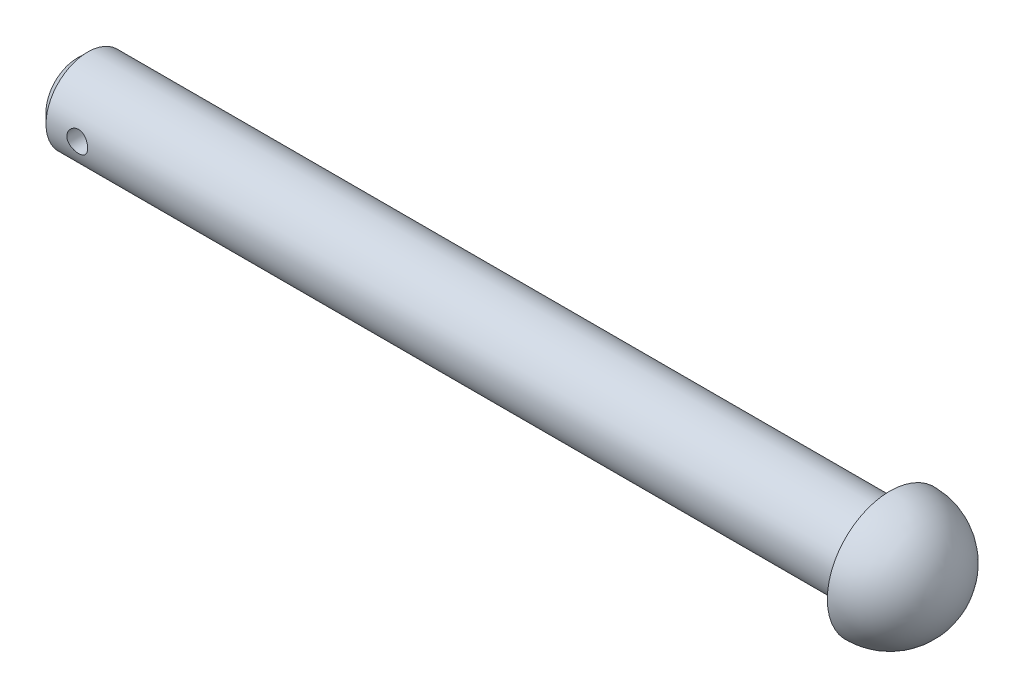
ISO-10303-21;
HEADER;
FILE_DESCRIPTION(('STEP AP214'),'2;1');
FILE_NAME('part.step','',(''),(''),'','','');
FILE_SCHEMA(('AUTOMOTIVE_DESIGN { 1 0 10303 214 1 1 1 1 }'));
ENDSEC;
DATA;
#1=APPLICATION_CONTEXT('core data for automotive mechanical design processes');
#2=APPLICATION_PROTOCOL_DEFINITION('international standard','automotive_design',2000,#1);
#3=PRODUCT_CONTEXT('',#1,'mechanical');
#4=PRODUCT('Part','Part','',(#3));
#5=PRODUCT_RELATED_PRODUCT_CATEGORY('part','',(#4));
#6=PRODUCT_DEFINITION_FORMATION('','',#4);
#7=PRODUCT_DEFINITION_CONTEXT('part definition',#1,'design');
#8=PRODUCT_DEFINITION('design','',#6,#7);
#9=PRODUCT_DEFINITION_SHAPE('','',#8);
#10=(LENGTH_UNIT() NAMED_UNIT(*) SI_UNIT(.MILLI.,.METRE.));
#11=(NAMED_UNIT(*) PLANE_ANGLE_UNIT() SI_UNIT($,.RADIAN.));
#12=(NAMED_UNIT(*) SI_UNIT($,.STERADIAN.) SOLID_ANGLE_UNIT());
#13=UNCERTAINTY_MEASURE_WITH_UNIT(LENGTH_MEASURE(1.E-05),#10,'distance_accuracy_value','');
#14=(GEOMETRIC_REPRESENTATION_CONTEXT(3) GLOBAL_UNCERTAINTY_ASSIGNED_CONTEXT((#13)) GLOBAL_UNIT_ASSIGNED_CONTEXT((#10,
#11,#12)) REPRESENTATION_CONTEXT('',''));
#15=CARTESIAN_POINT('',(0.,0.,0.));
#16=DIRECTION('',(0.,0.,1.));
#17=DIRECTION('',(1.,0.,0.));
#18=AXIS2_PLACEMENT_3D('',#15,#16,#17);
#19=CARTESIAN_POINT('',(0.,0.,0.));
#20=DIRECTION('',(1.,0.,0.));
#21=DIRECTION('',(0.,0.,-1.));
#22=AXIS2_PLACEMENT_3D('',#19,#20,#21);
#23=PLANE('',#22);
#24=CARTESIAN_POINT('',(0.,0.,0.));
#25=DIRECTION('',(-1.,0.,0.));
#26=DIRECTION('',(0.,0.,1.));
#27=AXIS2_PLACEMENT_3D('',#24,#25,#26);
#28=CIRCLE('',#27,1.5);
#29=CARTESIAN_POINT('',(0.,0.,1.5));
#30=VERTEX_POINT('',#29);
#31=EDGE_CURVE('E10',#30,#30,#28,.T.);
#32=ORIENTED_EDGE('',*,*,#31,.T.);
#33=EDGE_LOOP('',(#32));
#34=FACE_BOUND('',#33,.T.);
#35=ADVANCED_FACE('F41',(#34),#23,.F.);
#36=CARTESIAN_POINT('',(0.5,0.,0.));
#37=DIRECTION('',(1.,0.,0.));
#38=DIRECTION('',(0.,0.,-1.));
#39=AXIS2_PLACEMENT_3D('',#36,#37,#38);
#40=CONICAL_SURFACE('',#39,2.,0.785398163397448);
#41=ORIENTED_EDGE('',*,*,#31,.F.);
#42=EDGE_LOOP('',(#41));
#43=FACE_BOUND('',#42,.T.);
#44=CARTESIAN_POINT('',(0.5,0.,0.));
#45=DIRECTION('',(-1.,0.,0.));
#46=DIRECTION('',(0.,0.,1.));
#47=AXIS2_PLACEMENT_3D('',#44,#45,#46);
#48=CIRCLE('',#47,2.);
#49=CARTESIAN_POINT('',(0.5,0.,2.));
#50=VERTEX_POINT('',#49);
#51=EDGE_CURVE('E53',#50,#50,#48,.T.);
#52=ORIENTED_EDGE('',*,*,#51,.T.);
#53=EDGE_LOOP('',(#52));
#54=FACE_BOUND('',#53,.T.);
#55=ADVANCED_FACE('F84',(#43,#54),#40,.T.);
#56=CARTESIAN_POINT('',(0.,0.,0.));
#57=DIRECTION('',(-1.,0.,0.));
#58=DIRECTION('',(0.,0.,1.));
#59=AXIS2_PLACEMENT_3D('',#56,#57,#58);
#60=CYLINDRICAL_SURFACE('',#59,2.);
#61=CARTESIAN_POINT('',(2.5,0.,2.));
#62=CARTESIAN_POINT('',(2.49999922475395,-0.0276253628899104,1.99999953289338));
#63=CARTESIAN_POINT('',(2.49770281640874,-0.0552593859435878,1.99942192710609));
#64=CARTESIAN_POINT('',(2.488591616231,-0.109735441256844,1.99717371276631));
#65=CARTESIAN_POINT('',(2.48177426348739,-0.13657701562358,1.99550248473323));
#66=CARTESIAN_POINT('',(2.46385358217931,-0.188673624060859,1.99125208777347));
#67=CARTESIAN_POINT('',(2.45275540042824,-0.213930521143334,1.98867400947362));
#68=CARTESIAN_POINT('',(2.42660620331839,-0.262224043968142,1.98288447935864));
#69=CARTESIAN_POINT('',(2.41155505462702,-0.28526059478292,1.97967300618017));
#70=CARTESIAN_POINT('',(2.37759973678193,-0.328933975766973,1.97289137863934));
#71=CARTESIAN_POINT('',(2.35862947501361,-0.349518563353691,1.96931569049511));
#72=CARTESIAN_POINT('',(2.31751593169703,-0.387249642401101,1.96224540039176));
#73=CARTESIAN_POINT('',(2.29537229235117,-0.404395745649712,1.95875080762783));
#74=CARTESIAN_POINT('',(2.24813492442086,-0.435008847599677,1.9521825856657));
#75=CARTESIAN_POINT('',(2.22300225639653,-0.448417405308452,1.94911598156868));
#76=CARTESIAN_POINT('',(2.17075052944721,-0.470798969516842,1.94383164937408));
#77=CARTESIAN_POINT('',(2.14363178889141,-0.479772685146444,1.94161378557596));
#78=CARTESIAN_POINT('',(2.08875216726584,-0.492851612268097,1.93833492239184));
#79=CARTESIAN_POINT('',(2.06101503465007,-0.497050756111113,1.93725163691809));
#80=CARTESIAN_POINT('',(2.00521047699534,-0.500753925022617,1.9362978751258));
#81=CARTESIAN_POINT('',(1.9771431064338,-0.500258713939326,1.93642720149548));
#82=CARTESIAN_POINT('',(1.92219473075184,-0.49466217487976,1.93786401832206));
#83=CARTESIAN_POINT('',(1.89530145951164,-0.489672780063507,1.93914287667293));
#84=CARTESIAN_POINT('',(1.8427463163629,-0.475408062301035,1.94268903225495));
#85=CARTESIAN_POINT('',(1.81708453232367,-0.466132434023141,1.94495639990232));
#86=CARTESIAN_POINT('',(1.76742066124931,-0.443463159312384,1.95025037968062));
#87=CARTESIAN_POINT('',(1.74343794273682,-0.430028889077637,1.95328442489807));
#88=CARTESIAN_POINT('',(1.69802709674772,-0.399452092004985,1.95976570282129));
#89=CARTESIAN_POINT('',(1.67659941731092,-0.382308916269613,1.96321300778245));
#90=CARTESIAN_POINT('',(1.6362654614352,-0.344221141560406,1.9702529351326));
#91=CARTESIAN_POINT('',(1.61744850331289,-0.323182086055286,1.9738468982599));
#92=CARTESIAN_POINT('',(1.5835929191787,-0.278203972501233,1.98068655192929));
#93=CARTESIAN_POINT('',(1.56855440857881,-0.254264825902648,1.98393223183138));
#94=CARTESIAN_POINT('',(1.54264980459187,-0.204038629560464,1.98972577364727));
#95=CARTESIAN_POINT('',(1.53179821991519,-0.177743797736208,1.99227120042575));
#96=CARTESIAN_POINT('',(1.51469423143014,-0.123625336047627,1.99635972330473));
#97=CARTESIAN_POINT('',(1.50844094786062,-0.095801999716828,1.99790301113094));
#98=CARTESIAN_POINT('',(1.50084747814706,-0.0401799901300087,1.99978499757125));
#99=CARTESIAN_POINT('',(1.4993856579749,-0.0123989066627364,2.00015351169426));
#100=CARTESIAN_POINT('',(1.50108300068516,0.0430109582671695,1.9997293493815));
#101=CARTESIAN_POINT('',(1.50424174759971,0.0706397532148652,1.99893677747282));
#102=CARTESIAN_POINT('',(1.51499030279713,0.124538089592164,1.99629860375786));
#103=CARTESIAN_POINT('',(1.52251375449233,0.150821706322918,1.99446878061937));
#104=CARTESIAN_POINT('',(1.54170236134282,0.201752430817504,1.98996235544711));
#105=CARTESIAN_POINT('',(1.55336793477106,0.226399373010878,1.98728566789964));
#106=CARTESIAN_POINT('',(1.58074537629158,0.273841044809949,1.98131102642103));
#107=CARTESIAN_POINT('',(1.59652537079892,0.29659514727861,1.97800289122311));
#108=CARTESIAN_POINT('',(1.63159663626566,0.339175537881082,1.97114836395806));
#109=CARTESIAN_POINT('',(1.65088851320564,0.359001319657669,1.96760193083902));
#110=CARTESIAN_POINT('',(1.69300065361482,0.39566352269091,1.96056318986924));
#111=CARTESIAN_POINT('',(1.71589590100081,0.412414622540677,1.95707434729094));
#112=CARTESIAN_POINT('',(1.76424421148857,0.441836919670899,1.95064292792413));
#113=CARTESIAN_POINT('',(1.78969716098659,0.454508298052646,1.94770032689009));
#114=CARTESIAN_POINT('',(1.84230190747103,0.475317140203097,1.94272698244888));
#115=CARTESIAN_POINT('',(1.86944254278134,0.483481465551355,1.94069085097302));
#116=CARTESIAN_POINT('',(1.92476987929637,0.495115219984593,1.93775581363394));
#117=CARTESIAN_POINT('',(1.95295635034417,0.498585675826219,1.93685665906645));
#118=CARTESIAN_POINT('',(2.00870700795174,0.500679530111331,1.93631633734652));
#119=CARTESIAN_POINT('',(2.03626581170825,0.499439299260039,1.93663977576088));
#120=CARTESIAN_POINT('',(2.09076796288933,0.492459092770955,1.93842636335948));
#121=CARTESIAN_POINT('',(2.11771132267122,0.486719207562256,1.93988948963952));
#122=CARTESIAN_POINT('',(2.17006948635514,0.470977106480931,1.94377086894241));
#123=CARTESIAN_POINT('',(2.19549243508007,0.461000468226792,1.94618338412103));
#124=CARTESIAN_POINT('',(2.2443217942379,0.437088304535023,1.95169251908276));
#125=CARTESIAN_POINT('',(2.26772792439564,0.423152230011396,1.95478923373591));
#126=CARTESIAN_POINT('',(2.31251820966734,0.391289249545712,1.96141878087837));
#127=CARTESIAN_POINT('',(2.33383369114132,0.373267720970751,1.96496088277252));
#128=CARTESIAN_POINT('',(2.37318234826514,0.333929790396578,1.97202675748762));
#129=CARTESIAN_POINT('',(2.39121474337099,0.312612607087048,1.97555052575687));
#130=CARTESIAN_POINT('',(2.42380376952154,0.266822528900863,1.98225885215888));
#131=CARTESIAN_POINT('',(2.43829153789053,0.242299474105462,1.98543611121956));
#132=CARTESIAN_POINT('',(2.46291582098018,0.191088686503492,1.99101641658373));
#133=CARTESIAN_POINT('',(2.47305545354951,0.16440252114558,1.9934200173326));
#134=CARTESIAN_POINT('',(2.48719061010989,0.114803417747824,1.99682686521847));
#135=CARTESIAN_POINT('',(2.49198374768448,0.0921267236360226,1.9980086168423));
#136=CARTESIAN_POINT('',(2.49838864787398,0.0463020238454276,1.99959535077316));
#137=CARTESIAN_POINT('',(2.50000064976844,0.0231540537475387,2.00000039150298));
#138=CARTESIAN_POINT('',(2.5,0.,2.));
#139=B_SPLINE_CURVE_WITH_KNOTS('',3,(#61,#62,#63,#64,#65,#66,#67,#68,#69,#70,#71,#72,#73,#74,
#75,#76,#77,#78,#79,#80,#81,#82,#83,#84,#85,#86,#87,#88,#89,#90,#91,#92,#93,#94,#95,#96,#97,#98,
#99,#100,#101,#102,#103,#104,#105,#106,#107,#108,#109,#110,#111,#112,#113,#114,#115,#116,#117,
#118,#119,#120,#121,#122,#123,#124,#125,#126,#127,#128,#129,#130,#131,#132,#133,#134,#135,#136,
#137,#138),.UNSPECIFIED.,.T.,.F.,(4,2,2,2,2,2,2,2,2,2,2,2,2,2,2,2,2,2,2,2,2,2,2,2,2,2,2,2,2,2,2,
2,2,2,2,2,2,2,4),(0.,0.0827912374906299,0.165629412587967,0.248368300762035,0.331109980056443,
0.41538145145713,0.49966243193354,0.585195491819357,0.670714870564561,0.754520983664767,
0.838313460375656,0.920074990023393,1.00184234488679,1.08443509291293,1.16704230278721,
1.25200500323006,1.33697029852749,1.42222743003038,1.50746824562881,1.59052769649759,
1.67357967037581,1.75540091504679,1.83723042440763,1.92051195855117,2.0038078766934,
2.08914836401492,2.17448506249836,2.25930751538012,2.34411141084136,2.42647926799537,
2.50884546985345,2.59072133519816,2.67260856045634,2.75663192136637,2.84067523256806,
2.92624061833196,3.01174454607117,3.08114080980716,3.1505318534768),.UNSPECIFIED.);
#140=CARTESIAN_POINT('',(2.5,0.,2.));
#141=VERTEX_POINT('',#140);
#142=EDGE_CURVE('E44',#141,#141,#139,.T.);
#143=ORIENTED_EDGE('',*,*,#142,.T.);
#144=EDGE_LOOP('',(#143));
#145=FACE_BOUND('',#144,.T.);
#146=CARTESIAN_POINT('',(2.5,0.,-2.));
#147=CARTESIAN_POINT('',(2.49999922475395,0.0276253628899104,-1.99999953289338));
#148=CARTESIAN_POINT('',(2.49770281640874,0.0552593859435878,-1.99942192710609));
#149=CARTESIAN_POINT('',(2.488591616231,0.109735441256844,-1.99717371276631));
#150=CARTESIAN_POINT('',(2.48177426348739,0.13657701562358,-1.99550248473323));
#151=CARTESIAN_POINT('',(2.46385358217931,0.188673624060859,-1.99125208777347));
#152=CARTESIAN_POINT('',(2.45275540042824,0.213930521143334,-1.98867400947362));
#153=CARTESIAN_POINT('',(2.42660620331839,0.262224043968142,-1.98288447935864));
#154=CARTESIAN_POINT('',(2.41155505462702,0.28526059478292,-1.97967300618017));
#155=CARTESIAN_POINT('',(2.37759973678193,0.328933975766973,-1.97289137863934));
#156=CARTESIAN_POINT('',(2.35862947501361,0.349518563353691,-1.96931569049511));
#157=CARTESIAN_POINT('',(2.31751593169703,0.387249642401101,-1.96224540039176));
#158=CARTESIAN_POINT('',(2.29537229235117,0.404395745649712,-1.95875080762783));
#159=CARTESIAN_POINT('',(2.24813492442086,0.435008847599677,-1.9521825856657));
#160=CARTESIAN_POINT('',(2.22300225639653,0.448417405308452,-1.94911598156868));
#161=CARTESIAN_POINT('',(2.17075052944721,0.470798969516842,-1.94383164937408));
#162=CARTESIAN_POINT('',(2.14363178889141,0.479772685146444,-1.94161378557596));
#163=CARTESIAN_POINT('',(2.08875216726584,0.492851612268097,-1.93833492239184));
#164=CARTESIAN_POINT('',(2.06101503465007,0.497050756111113,-1.93725163691809));
#165=CARTESIAN_POINT('',(2.00521047699534,0.500753925022617,-1.9362978751258));
#166=CARTESIAN_POINT('',(1.9771431064338,0.500258713939326,-1.93642720149548));
#167=CARTESIAN_POINT('',(1.92219473075184,0.49466217487976,-1.93786401832206));
#168=CARTESIAN_POINT('',(1.89530145951164,0.489672780063507,-1.93914287667293));
#169=CARTESIAN_POINT('',(1.8427463163629,0.475408062301035,-1.94268903225495));
#170=CARTESIAN_POINT('',(1.81708453232367,0.466132434023141,-1.94495639990232));
#171=CARTESIAN_POINT('',(1.76742066124931,0.443463159312384,-1.95025037968062));
#172=CARTESIAN_POINT('',(1.74343794273682,0.430028889077637,-1.95328442489807));
#173=CARTESIAN_POINT('',(1.69802709674772,0.399452092004985,-1.95976570282129));
#174=CARTESIAN_POINT('',(1.67659941731092,0.382308916269613,-1.96321300778245));
#175=CARTESIAN_POINT('',(1.6362654614352,0.344221141560406,-1.9702529351326));
#176=CARTESIAN_POINT('',(1.61744850331289,0.323182086055286,-1.9738468982599));
#177=CARTESIAN_POINT('',(1.5835929191787,0.278203972501233,-1.98068655192929));
#178=CARTESIAN_POINT('',(1.56855440857881,0.254264825902648,-1.98393223183138));
#179=CARTESIAN_POINT('',(1.54264980459187,0.204038629560464,-1.98972577364727));
#180=CARTESIAN_POINT('',(1.53179821991519,0.177743797736208,-1.99227120042575));
#181=CARTESIAN_POINT('',(1.51469423143014,0.123625336047627,-1.99635972330473));
#182=CARTESIAN_POINT('',(1.50844094786062,0.095801999716828,-1.99790301113094));
#183=CARTESIAN_POINT('',(1.50084747814706,0.0401799901300087,-1.99978499757125));
#184=CARTESIAN_POINT('',(1.4993856579749,0.0123989066627364,-2.00015351169426));
#185=CARTESIAN_POINT('',(1.50108300068516,-0.0430109582671695,-1.9997293493815));
#186=CARTESIAN_POINT('',(1.50424174759971,-0.0706397532148652,-1.99893677747282));
#187=CARTESIAN_POINT('',(1.51499030279713,-0.124538089592164,-1.99629860375786));
#188=CARTESIAN_POINT('',(1.52251375449233,-0.150821706322918,-1.99446878061937));
#189=CARTESIAN_POINT('',(1.54170236134282,-0.201752430817504,-1.98996235544711));
#190=CARTESIAN_POINT('',(1.55336793477106,-0.226399373010878,-1.98728566789964));
#191=CARTESIAN_POINT('',(1.58074537629158,-0.273841044809949,-1.98131102642103));
#192=CARTESIAN_POINT('',(1.59652537079892,-0.29659514727861,-1.97800289122311));
#193=CARTESIAN_POINT('',(1.63159663626566,-0.339175537881082,-1.97114836395806));
#194=CARTESIAN_POINT('',(1.65088851320564,-0.359001319657669,-1.96760193083902));
#195=CARTESIAN_POINT('',(1.69300065361482,-0.39566352269091,-1.96056318986924));
#196=CARTESIAN_POINT('',(1.71589590100081,-0.412414622540677,-1.95707434729094));
#197=CARTESIAN_POINT('',(1.76424421148857,-0.441836919670899,-1.95064292792413));
#198=CARTESIAN_POINT('',(1.78969716098659,-0.454508298052646,-1.94770032689009));
#199=CARTESIAN_POINT('',(1.84230190747103,-0.475317140203097,-1.94272698244888));
#200=CARTESIAN_POINT('',(1.86944254278134,-0.483481465551355,-1.94069085097302));
#201=CARTESIAN_POINT('',(1.92476987929637,-0.495115219984593,-1.93775581363394));
#202=CARTESIAN_POINT('',(1.95295635034417,-0.498585675826219,-1.93685665906645));
#203=CARTESIAN_POINT('',(2.00870700795174,-0.500679530111331,-1.93631633734652));
#204=CARTESIAN_POINT('',(2.03626581170825,-0.499439299260039,-1.93663977576088));
#205=CARTESIAN_POINT('',(2.09076796288933,-0.492459092770955,-1.93842636335948));
#206=CARTESIAN_POINT('',(2.11771132267122,-0.486719207562256,-1.93988948963952));
#207=CARTESIAN_POINT('',(2.17006948635514,-0.470977106480931,-1.94377086894241));
#208=CARTESIAN_POINT('',(2.19549243508007,-0.461000468226792,-1.94618338412103));
#209=CARTESIAN_POINT('',(2.2443217942379,-0.437088304535023,-1.95169251908276));
#210=CARTESIAN_POINT('',(2.26772792439564,-0.423152230011396,-1.95478923373591));
#211=CARTESIAN_POINT('',(2.31251820966734,-0.391289249545712,-1.96141878087837));
#212=CARTESIAN_POINT('',(2.33383369114132,-0.373267720970751,-1.96496088277252));
#213=CARTESIAN_POINT('',(2.37318234826514,-0.333929790396578,-1.97202675748762));
#214=CARTESIAN_POINT('',(2.39121474337099,-0.312612607087048,-1.97555052575687));
#215=CARTESIAN_POINT('',(2.42380376952154,-0.266822528900863,-1.98225885215888));
#216=CARTESIAN_POINT('',(2.43829153789053,-0.242299474105462,-1.98543611121956));
#217=CARTESIAN_POINT('',(2.46291582098018,-0.191088686503492,-1.99101641658373));
#218=CARTESIAN_POINT('',(2.47305545354951,-0.16440252114558,-1.9934200173326));
#219=CARTESIAN_POINT('',(2.48719061010989,-0.114803417747824,-1.99682686521847));
#220=CARTESIAN_POINT('',(2.49198374768448,-0.0921267236360226,-1.9980086168423));
#221=CARTESIAN_POINT('',(2.49838864787398,-0.0463020238454276,-1.99959535077316));
#222=CARTESIAN_POINT('',(2.50000064976844,-0.0231540537475387,-2.00000039150298));
#223=CARTESIAN_POINT('',(2.5,0.,-2.));
#224=B_SPLINE_CURVE_WITH_KNOTS('',3,(#146,#147,#148,#149,#150,#151,#152,#153,#154,#155,#156,
#157,#158,#159,#160,#161,#162,#163,#164,#165,#166,#167,#168,#169,#170,#171,#172,#173,#174,#175,
#176,#177,#178,#179,#180,#181,#182,#183,#184,#185,#186,#187,#188,#189,#190,#191,#192,#193,#194,
#195,#196,#197,#198,#199,#200,#201,#202,#203,#204,#205,#206,#207,#208,#209,#210,#211,#212,#213,
#214,#215,#216,#217,#218,#219,#220,#221,#222,#223),.UNSPECIFIED.,.T.,.F.,(4,2,2,2,2,2,2,2,2,2,2,
2,2,2,2,2,2,2,2,2,2,2,2,2,2,2,2,2,2,2,2,2,2,2,2,2,2,2,4),(0.,0.0827912374906299,
0.165629412587967,0.248368300762035,0.331109980056443,0.41538145145713,0.49966243193354,
0.585195491819357,0.670714870564561,0.754520983664767,0.838313460375656,0.920074990023393,
1.00184234488679,1.08443509291293,1.16704230278721,1.25200500323006,1.33697029852749,
1.42222743003038,1.50746824562881,1.59052769649759,1.67357967037581,1.75540091504679,
1.83723042440763,1.92051195855117,2.0038078766934,2.08914836401492,2.17448506249836,
2.25930751538012,2.34411141084136,2.42647926799537,2.50884546985345,2.59072133519816,
2.67260856045634,2.75663192136637,2.84067523256806,2.92624061833196,3.01174454607117,
3.08114080980716,3.1505318534768),.UNSPECIFIED.);
#225=CARTESIAN_POINT('',(2.5,0.,-2.));
#226=VERTEX_POINT('',#225);
#227=EDGE_CURVE('E61',#226,#226,#224,.T.);
#228=ORIENTED_EDGE('',*,*,#227,.T.);
#229=EDGE_LOOP('',(#228));
#230=FACE_BOUND('',#229,.T.);
#231=ORIENTED_EDGE('',*,*,#51,.F.);
#232=EDGE_LOOP('',(#231));
#233=FACE_BOUND('',#232,.T.);
#234=CARTESIAN_POINT('',(39.,0.,0.));
#235=DIRECTION('',(-1.,0.,0.));
#236=DIRECTION('',(0.,0.,1.));
#237=AXIS2_PLACEMENT_3D('',#234,#235,#236);
#238=CIRCLE('',#237,2.);
#239=CARTESIAN_POINT('',(39.,0.,2.));
#240=VERTEX_POINT('',#239);
#241=EDGE_CURVE('E58',#240,#240,#238,.T.);
#242=ORIENTED_EDGE('',*,*,#241,.T.);
#243=EDGE_LOOP('',(#242));
#244=FACE_BOUND('',#243,.T.);
#245=ADVANCED_FACE('F66',(#145,#230,#233,#244),#60,.T.);
#246=CARTESIAN_POINT('',(39.,2.,0.));
#247=DIRECTION('',(1.,0.,0.));
#248=DIRECTION('',(0.,0.,-1.));
#249=AXIS2_PLACEMENT_3D('',#246,#247,#248);
#250=PLANE('',#249);
#251=ORIENTED_EDGE('',*,*,#241,.F.);
#252=EDGE_LOOP('',(#251));
#253=FACE_BOUND('',#252,.T.);
#254=CARTESIAN_POINT('',(39.,0.,0.));
#255=DIRECTION('',(-1.,0.,0.));
#256=DIRECTION('',(0.,0.,1.));
#257=AXIS2_PLACEMENT_3D('',#254,#255,#256);
#258=CIRCLE('',#257,3.);
#259=CARTESIAN_POINT('',(39.,0.,3.));
#260=VERTEX_POINT('',#259);
#261=EDGE_CURVE('E100',#260,#260,#258,.T.);
#262=ORIENTED_EDGE('',*,*,#261,.T.);
#263=EDGE_LOOP('',(#262));
#264=FACE_BOUND('',#263,.T.);
#265=ADVANCED_FACE('F77',(#253,#264),#250,.F.);
#266=CARTESIAN_POINT('',(39.,0.,0.));
#267=DIRECTION('',(-1.,0.,0.));
#268=DIRECTION('',(0.,1.,0.));
#269=AXIS2_PLACEMENT_3D('',#266,#267,#268);
#270=SPHERICAL_SURFACE('',#269,3.);
#271=ORIENTED_EDGE('',*,*,#261,.F.);
#272=EDGE_LOOP('',(#271));
#273=FACE_BOUND('',#272,.T.);
#274=ADVANCED_FACE('F73',(#273),#270,.T.);
#275=CARTESIAN_POINT('',(2.,0.,-3.));
#276=DIRECTION('',(0.,0.,1.));
#277=DIRECTION('',(1.,0.,0.));
#278=AXIS2_PLACEMENT_3D('',#275,#276,#277);
#279=CYLINDRICAL_SURFACE('',#278,0.5);
#280=ORIENTED_EDGE('',*,*,#227,.F.);
#281=EDGE_LOOP('',(#280));
#282=FACE_BOUND('',#281,.T.);
#283=ORIENTED_EDGE('',*,*,#142,.F.);
#284=EDGE_LOOP('',(#283));
#285=FACE_BOUND('',#284,.T.);
#286=ADVANCED_FACE('F69',(#282,#285),#279,.F.);
#287=CLOSED_SHELL('',(#35,#55,#245,#265,#274,#286));
#288=MANIFOLD_SOLID_BREP('B2',#287);
#289=ADVANCED_BREP_SHAPE_REPRESENTATION('',(#18,#288),#14);
#290=SHAPE_DEFINITION_REPRESENTATION(#9,#289);
ENDSEC;
END-ISO-10303-21;
